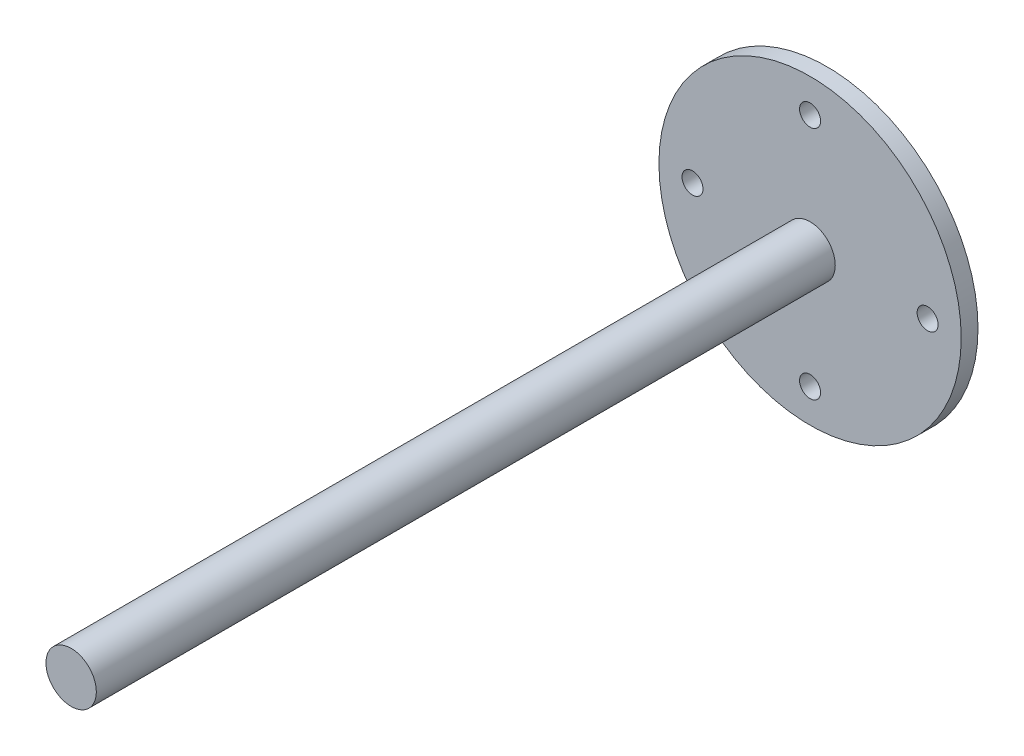
ISO-10303-21;
HEADER;
FILE_DESCRIPTION(('STEP AP214'),'2;1');
FILE_NAME('part.step','',(''),(''),'','','');
FILE_SCHEMA(('AUTOMOTIVE_DESIGN { 1 0 10303 214 1 1 1 1 }'));
ENDSEC;
DATA;
#1=APPLICATION_CONTEXT('core data for automotive mechanical design processes');
#2=APPLICATION_PROTOCOL_DEFINITION('international standard','automotive_design',2000,#1);
#3=PRODUCT_CONTEXT('',#1,'mechanical');
#4=PRODUCT('Part','Part','',(#3));
#5=PRODUCT_RELATED_PRODUCT_CATEGORY('part','',(#4));
#6=PRODUCT_DEFINITION_FORMATION('','',#4);
#7=PRODUCT_DEFINITION_CONTEXT('part definition',#1,'design');
#8=PRODUCT_DEFINITION('design','',#6,#7);
#9=PRODUCT_DEFINITION_SHAPE('','',#8);
#10=(LENGTH_UNIT() NAMED_UNIT(*) SI_UNIT(.MILLI.,.METRE.));
#11=(NAMED_UNIT(*) PLANE_ANGLE_UNIT() SI_UNIT($,.RADIAN.));
#12=(NAMED_UNIT(*) SI_UNIT($,.STERADIAN.) SOLID_ANGLE_UNIT());
#13=UNCERTAINTY_MEASURE_WITH_UNIT(LENGTH_MEASURE(1.E-05),#10,'distance_accuracy_value','');
#14=(GEOMETRIC_REPRESENTATION_CONTEXT(3) GLOBAL_UNCERTAINTY_ASSIGNED_CONTEXT((#13)) GLOBAL_UNIT_ASSIGNED_CONTEXT((#10,
#11,#12)) REPRESENTATION_CONTEXT('',''));
#15=CARTESIAN_POINT('',(0.,0.,0.));
#16=DIRECTION('',(0.,0.,1.));
#17=DIRECTION('',(1.,0.,0.));
#18=AXIS2_PLACEMENT_3D('',#15,#16,#17);
#19=CARTESIAN_POINT('',(0.,0.,6.35));
#20=DIRECTION('',(0.,0.,1.));
#21=DIRECTION('',(1.,0.,0.));
#22=AXIS2_PLACEMENT_3D('',#19,#20,#21);
#23=PLANE('',#22);
#24=CARTESIAN_POINT('',(0.,0.,6.35));
#25=DIRECTION('',(0.,0.,1.));
#26=DIRECTION('',(1.,0.,0.));
#27=AXIS2_PLACEMENT_3D('',#24,#25,#26);
#28=CIRCLE('',#27,9.525);
#29=CARTESIAN_POINT('',(9.525,0.,6.35));
#30=VERTEX_POINT('',#29);
#31=EDGE_CURVE('E90',#30,#30,#28,.T.);
#32=ORIENTED_EDGE('',*,*,#31,.F.);
#33=EDGE_LOOP('',(#32));
#34=FACE_BOUND('',#33,.T.);
#35=CARTESIAN_POINT('',(0.,-44.45,6.35));
#36=DIRECTION('',(0.,0.,1.));
#37=DIRECTION('',(1.,0.,0.));
#38=AXIS2_PLACEMENT_3D('',#35,#36,#37);
#39=CIRCLE('',#38,3.96875);
#40=CARTESIAN_POINT('',(3.96875000000001,-44.45,6.35));
#41=VERTEX_POINT('',#40);
#42=EDGE_CURVE('E70',#41,#41,#39,.T.);
#43=ORIENTED_EDGE('',*,*,#42,.F.);
#44=EDGE_LOOP('',(#43));
#45=FACE_BOUND('',#44,.T.);
#46=CARTESIAN_POINT('',(0.,44.45,6.35));
#47=DIRECTION('',(0.,0.,1.));
#48=DIRECTION('',(1.,0.,0.));
#49=AXIS2_PLACEMENT_3D('',#46,#47,#48);
#50=CIRCLE('',#49,3.96875);
#51=CARTESIAN_POINT('',(3.96875,44.45,6.35));
#52=VERTEX_POINT('',#51);
#53=EDGE_CURVE('E56',#52,#52,#50,.T.);
#54=ORIENTED_EDGE('',*,*,#53,.F.);
#55=EDGE_LOOP('',(#54));
#56=FACE_BOUND('',#55,.T.);
#57=CARTESIAN_POINT('',(0.,0.,6.35));
#58=DIRECTION('',(0.,0.,1.));
#59=DIRECTION('',(1.,0.,0.));
#60=AXIS2_PLACEMENT_3D('',#57,#58,#59);
#61=CIRCLE('',#60,57.15);
#62=CARTESIAN_POINT('',(57.15,0.,6.35));
#63=VERTEX_POINT('',#62);
#64=EDGE_CURVE('E10',#63,#63,#61,.T.);
#65=ORIENTED_EDGE('',*,*,#64,.T.);
#66=EDGE_LOOP('',(#65));
#67=FACE_BOUND('',#66,.T.);
#68=CARTESIAN_POINT('',(44.45,0.,6.35));
#69=DIRECTION('',(0.,0.,1.));
#70=DIRECTION('',(1.,0.,0.));
#71=AXIS2_PLACEMENT_3D('',#68,#69,#70);
#72=CIRCLE('',#71,3.96875);
#73=CARTESIAN_POINT('',(48.41875,0.,6.35));
#74=VERTEX_POINT('',#73);
#75=EDGE_CURVE('E62',#74,#74,#72,.T.);
#76=ORIENTED_EDGE('',*,*,#75,.F.);
#77=EDGE_LOOP('',(#76));
#78=FACE_BOUND('',#77,.T.);
#79=CARTESIAN_POINT('',(-44.45,0.,6.35));
#80=DIRECTION('',(0.,0.,1.));
#81=DIRECTION('',(1.,0.,0.));
#82=AXIS2_PLACEMENT_3D('',#79,#80,#81);
#83=CIRCLE('',#82,3.96875);
#84=CARTESIAN_POINT('',(-40.48125,0.,6.35));
#85=VERTEX_POINT('',#84);
#86=EDGE_CURVE('E78',#85,#85,#83,.T.);
#87=ORIENTED_EDGE('',*,*,#86,.F.);
#88=EDGE_LOOP('',(#87));
#89=FACE_BOUND('',#88,.T.);
#90=ADVANCED_FACE('F43',(#34,#45,#56,#67,#78,#89),#23,.T.);
#91=CARTESIAN_POINT('',(0.,0.,0.));
#92=DIRECTION('',(0.,0.,1.));
#93=DIRECTION('',(1.,0.,0.));
#94=AXIS2_PLACEMENT_3D('',#91,#92,#93);
#95=PLANE('',#94);
#96=CARTESIAN_POINT('',(0.,0.,0.));
#97=DIRECTION('',(0.,0.,1.));
#98=DIRECTION('',(1.,0.,0.));
#99=AXIS2_PLACEMENT_3D('',#96,#97,#98);
#100=CIRCLE('',#99,57.15);
#101=CARTESIAN_POINT('',(57.15,0.,0.));
#102=VERTEX_POINT('',#101);
#103=EDGE_CURVE('E47',#102,#102,#100,.T.);
#104=ORIENTED_EDGE('',*,*,#103,.F.);
#105=EDGE_LOOP('',(#104));
#106=FACE_BOUND('',#105,.T.);
#107=CARTESIAN_POINT('',(0.,44.45,0.));
#108=DIRECTION('',(0.,0.,1.));
#109=DIRECTION('',(1.,0.,0.));
#110=AXIS2_PLACEMENT_3D('',#107,#108,#109);
#111=CIRCLE('',#110,3.96875);
#112=CARTESIAN_POINT('',(3.96875,44.45,0.));
#113=VERTEX_POINT('',#112);
#114=EDGE_CURVE('E58',#113,#113,#111,.T.);
#115=ORIENTED_EDGE('',*,*,#114,.T.);
#116=EDGE_LOOP('',(#115));
#117=FACE_BOUND('',#116,.T.);
#118=CARTESIAN_POINT('',(44.45,0.,0.));
#119=DIRECTION('',(0.,0.,1.));
#120=DIRECTION('',(1.,0.,0.));
#121=AXIS2_PLACEMENT_3D('',#118,#119,#120);
#122=CIRCLE('',#121,3.96875);
#123=CARTESIAN_POINT('',(48.41875,0.,0.));
#124=VERTEX_POINT('',#123);
#125=EDGE_CURVE('E66',#124,#124,#122,.T.);
#126=ORIENTED_EDGE('',*,*,#125,.T.);
#127=EDGE_LOOP('',(#126));
#128=FACE_BOUND('',#127,.T.);
#129=CARTESIAN_POINT('',(0.,-44.45,0.));
#130=DIRECTION('',(0.,0.,1.));
#131=DIRECTION('',(1.,0.,0.));
#132=AXIS2_PLACEMENT_3D('',#129,#130,#131);
#133=CIRCLE('',#132,3.96875);
#134=CARTESIAN_POINT('',(3.96875000000001,-44.45,0.));
#135=VERTEX_POINT('',#134);
#136=EDGE_CURVE('E74',#135,#135,#133,.T.);
#137=ORIENTED_EDGE('',*,*,#136,.T.);
#138=EDGE_LOOP('',(#137));
#139=FACE_BOUND('',#138,.T.);
#140=CARTESIAN_POINT('',(-44.45,0.,0.));
#141=DIRECTION('',(0.,0.,1.));
#142=DIRECTION('',(1.,0.,0.));
#143=AXIS2_PLACEMENT_3D('',#140,#141,#142);
#144=CIRCLE('',#143,3.96875);
#145=CARTESIAN_POINT('',(-40.48125,0.,0.));
#146=VERTEX_POINT('',#145);
#147=EDGE_CURVE('E82',#146,#146,#144,.T.);
#148=ORIENTED_EDGE('',*,*,#147,.T.);
#149=EDGE_LOOP('',(#148));
#150=FACE_BOUND('',#149,.T.);
#151=ADVANCED_FACE('F109',(#106,#117,#128,#139,#150),#95,.F.);
#152=CARTESIAN_POINT('',(0.,0.,6.35));
#153=DIRECTION('',(0.,0.,-1.));
#154=DIRECTION('',(-1.,0.,0.));
#155=AXIS2_PLACEMENT_3D('',#152,#153,#154);
#156=CYLINDRICAL_SURFACE('',#155,57.15);
#157=ORIENTED_EDGE('',*,*,#64,.F.);
#158=EDGE_LOOP('',(#157));
#159=FACE_BOUND('',#158,.T.);
#160=ORIENTED_EDGE('',*,*,#103,.T.);
#161=EDGE_LOOP('',(#160));
#162=FACE_BOUND('',#161,.T.);
#163=ADVANCED_FACE('F45',(#159,#162),#156,.T.);
#164=CARTESIAN_POINT('',(0.,44.45,6.35));
#165=DIRECTION('',(0.,0.,-1.));
#166=DIRECTION('',(-1.,0.,0.));
#167=AXIS2_PLACEMENT_3D('',#164,#165,#166);
#168=CYLINDRICAL_SURFACE('',#167,3.96875);
#169=ORIENTED_EDGE('',*,*,#53,.T.);
#170=EDGE_LOOP('',(#169));
#171=FACE_BOUND('',#170,.T.);
#172=ORIENTED_EDGE('',*,*,#114,.F.);
#173=EDGE_LOOP('',(#172));
#174=FACE_BOUND('',#173,.T.);
#175=ADVANCED_FACE('F130',(#171,#174),#168,.F.);
#176=CARTESIAN_POINT('',(44.45,0.,6.35));
#177=DIRECTION('',(0.,0.,-1.));
#178=DIRECTION('',(-1.,0.,0.));
#179=AXIS2_PLACEMENT_3D('',#176,#177,#178);
#180=CYLINDRICAL_SURFACE('',#179,3.96875);
#181=ORIENTED_EDGE('',*,*,#75,.T.);
#182=EDGE_LOOP('',(#181));
#183=FACE_BOUND('',#182,.T.);
#184=ORIENTED_EDGE('',*,*,#125,.F.);
#185=EDGE_LOOP('',(#184));
#186=FACE_BOUND('',#185,.T.);
#187=ADVANCED_FACE('F137',(#183,#186),#180,.F.);
#188=CARTESIAN_POINT('',(0.,-44.45,6.35));
#189=DIRECTION('',(0.,0.,-1.));
#190=DIRECTION('',(-1.,0.,0.));
#191=AXIS2_PLACEMENT_3D('',#188,#189,#190);
#192=CYLINDRICAL_SURFACE('',#191,3.96875);
#193=ORIENTED_EDGE('',*,*,#42,.T.);
#194=EDGE_LOOP('',(#193));
#195=FACE_BOUND('',#194,.T.);
#196=ORIENTED_EDGE('',*,*,#136,.F.);
#197=EDGE_LOOP('',(#196));
#198=FACE_BOUND('',#197,.T.);
#199=ADVANCED_FACE('F121',(#195,#198),#192,.F.);
#200=CARTESIAN_POINT('',(-44.45,0.,6.35));
#201=DIRECTION('',(0.,0.,-1.));
#202=DIRECTION('',(-1.,0.,0.));
#203=AXIS2_PLACEMENT_3D('',#200,#201,#202);
#204=CYLINDRICAL_SURFACE('',#203,3.96875);
#205=ORIENTED_EDGE('',*,*,#86,.T.);
#206=EDGE_LOOP('',(#205));
#207=FACE_BOUND('',#206,.T.);
#208=ORIENTED_EDGE('',*,*,#147,.F.);
#209=EDGE_LOOP('',(#208));
#210=FACE_BOUND('',#209,.T.);
#211=ADVANCED_FACE('F103',(#207,#210),#204,.F.);
#212=CARTESIAN_POINT('',(0.,0.,285.75));
#213=DIRECTION('',(0.,0.,-1.));
#214=DIRECTION('',(-1.,0.,0.));
#215=AXIS2_PLACEMENT_3D('',#212,#213,#214);
#216=CYLINDRICAL_SURFACE('',#215,9.525);
#217=CARTESIAN_POINT('',(0.,0.,285.75));
#218=DIRECTION('',(0.,0.,1.));
#219=DIRECTION('',(1.,0.,0.));
#220=AXIS2_PLACEMENT_3D('',#217,#218,#219);
#221=CIRCLE('',#220,9.525);
#222=CARTESIAN_POINT('',(9.525,0.,285.75));
#223=VERTEX_POINT('',#222);
#224=EDGE_CURVE('E86',#223,#223,#221,.T.);
#225=ORIENTED_EDGE('',*,*,#224,.F.);
#226=EDGE_LOOP('',(#225));
#227=FACE_BOUND('',#226,.T.);
#228=ORIENTED_EDGE('',*,*,#31,.T.);
#229=EDGE_LOOP('',(#228));
#230=FACE_BOUND('',#229,.T.);
#231=ADVANCED_FACE('F100',(#227,#230),#216,.T.);
#232=CARTESIAN_POINT('',(0.,0.,285.75));
#233=DIRECTION('',(0.,0.,1.));
#234=DIRECTION('',(1.,0.,0.));
#235=AXIS2_PLACEMENT_3D('',#232,#233,#234);
#236=PLANE('',#235);
#237=ORIENTED_EDGE('',*,*,#224,.T.);
#238=EDGE_LOOP('',(#237));
#239=FACE_BOUND('',#238,.T.);
#240=ADVANCED_FACE('F98',(#239),#236,.T.);
#241=CLOSED_SHELL('',(#90,#151,#163,#175,#187,#199,#211,#231,#240));
#242=MANIFOLD_SOLID_BREP('B2',#241);
#243=ADVANCED_BREP_SHAPE_REPRESENTATION('',(#18,#242),#14);
#244=SHAPE_DEFINITION_REPRESENTATION(#9,#243);
ENDSEC;
END-ISO-10303-21;
